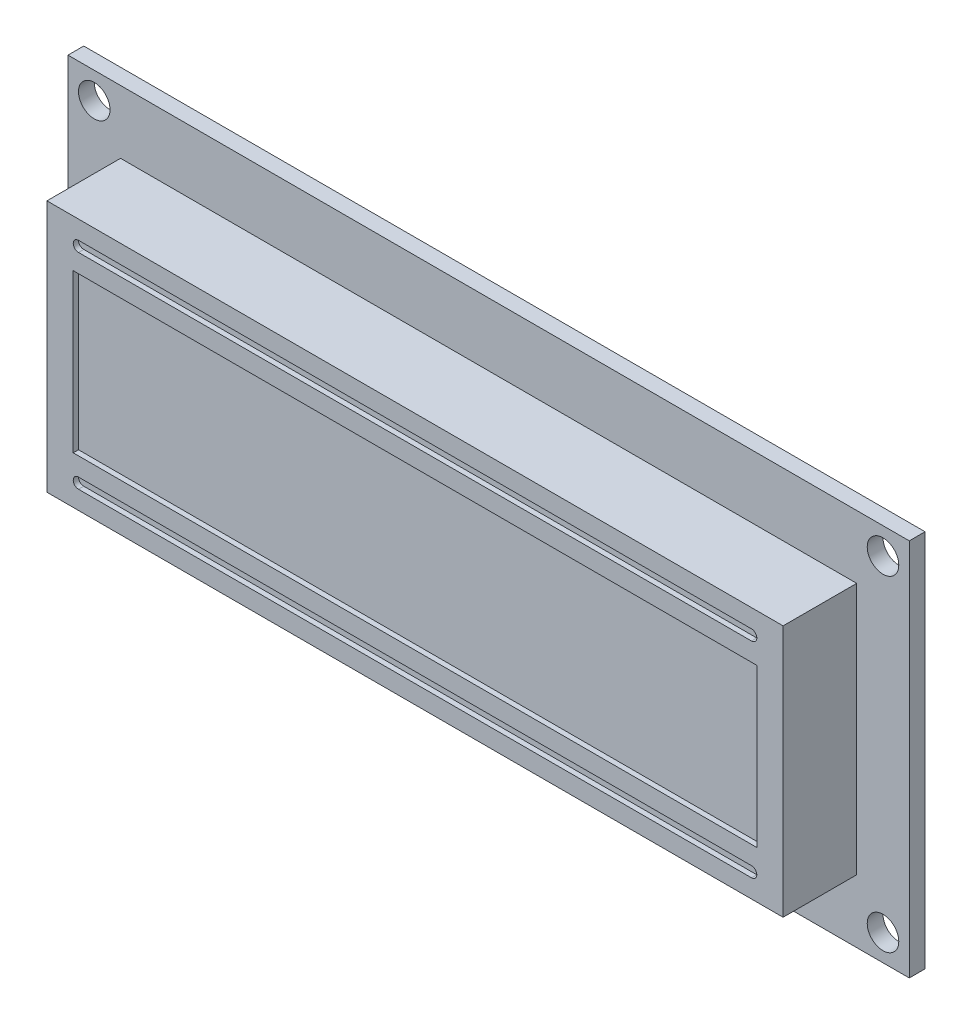
ISO-10303-21;
HEADER;
FILE_DESCRIPTION(('STEP AP214'),'2;1');
FILE_NAME('part.step','',(''),(''),'','','');
FILE_SCHEMA(('AUTOMOTIVE_DESIGN { 1 0 10303 214 1 1 1 1 }'));
ENDSEC;
DATA;
#1=APPLICATION_CONTEXT('core data for automotive mechanical design processes');
#2=APPLICATION_PROTOCOL_DEFINITION('international standard','automotive_design',2000,#1);
#3=PRODUCT_CONTEXT('',#1,'mechanical');
#4=PRODUCT('Part','Part','',(#3));
#5=PRODUCT_RELATED_PRODUCT_CATEGORY('part','',(#4));
#6=PRODUCT_DEFINITION_FORMATION('','',#4);
#7=PRODUCT_DEFINITION_CONTEXT('part definition',#1,'design');
#8=PRODUCT_DEFINITION('design','',#6,#7);
#9=PRODUCT_DEFINITION_SHAPE('','',#8);
#10=(LENGTH_UNIT() NAMED_UNIT(*) SI_UNIT(.MILLI.,.METRE.));
#11=(NAMED_UNIT(*) PLANE_ANGLE_UNIT() SI_UNIT($,.RADIAN.));
#12=(NAMED_UNIT(*) SI_UNIT($,.STERADIAN.) SOLID_ANGLE_UNIT());
#13=UNCERTAINTY_MEASURE_WITH_UNIT(LENGTH_MEASURE(1.E-05),#10,'distance_accuracy_value','');
#14=(GEOMETRIC_REPRESENTATION_CONTEXT(3) GLOBAL_UNCERTAINTY_ASSIGNED_CONTEXT((#13)) GLOBAL_UNIT_ASSIGNED_CONTEXT((#10,
#11,#12)) REPRESENTATION_CONTEXT('',''));
#15=CARTESIAN_POINT('',(0.,0.,0.));
#16=DIRECTION('',(0.,0.,1.));
#17=DIRECTION('',(1.,0.,0.));
#18=AXIS2_PLACEMENT_3D('',#15,#16,#17);
#19=CARTESIAN_POINT('',(0.,0.,0.));
#20=DIRECTION('',(0.,0.,1.));
#21=DIRECTION('',(1.,0.,0.));
#22=AXIS2_PLACEMENT_3D('',#19,#20,#21);
#23=PLANE('',#22);
#24=CARTESIAN_POINT('',(-37.5,-15.5,0.));
#25=DIRECTION('',(0.,0.,1.));
#26=DIRECTION('',(1.,0.,0.));
#27=AXIS2_PLACEMENT_3D('',#24,#25,#26);
#28=CIRCLE('',#27,1.5);
#29=CARTESIAN_POINT('',(-36.,-15.5,0.));
#30=VERTEX_POINT('',#29);
#31=EDGE_CURVE('E461',#30,#30,#28,.F.);
#32=ORIENTED_EDGE('',*,*,#31,.T.);
#33=EDGE_LOOP('',(#32));
#34=FACE_BOUND('',#33,.T.);
#35=CARTESIAN_POINT('',(-37.5,15.5,0.));
#36=DIRECTION('',(0.,0.,1.));
#37=DIRECTION('',(1.,0.,0.));
#38=AXIS2_PLACEMENT_3D('',#35,#36,#37);
#39=CIRCLE('',#38,1.5);
#40=CARTESIAN_POINT('',(-36.,15.5,0.));
#41=VERTEX_POINT('',#40);
#42=EDGE_CURVE('E465',#41,#41,#39,.F.);
#43=ORIENTED_EDGE('',*,*,#42,.T.);
#44=EDGE_LOOP('',(#43));
#45=FACE_BOUND('',#44,.T.);
#46=CARTESIAN_POINT('',(37.5,-15.5,0.));
#47=DIRECTION('',(0.,0.,1.));
#48=DIRECTION('',(1.,0.,0.));
#49=AXIS2_PLACEMENT_3D('',#46,#47,#48);
#50=CIRCLE('',#49,1.5);
#51=CARTESIAN_POINT('',(39.,-15.5,0.));
#52=VERTEX_POINT('',#51);
#53=EDGE_CURVE('E473',#52,#52,#50,.F.);
#54=ORIENTED_EDGE('',*,*,#53,.T.);
#55=EDGE_LOOP('',(#54));
#56=FACE_BOUND('',#55,.T.);
#57=CARTESIAN_POINT('',(37.5,15.5,0.));
#58=DIRECTION('',(0.,0.,1.));
#59=DIRECTION('',(1.,0.,0.));
#60=AXIS2_PLACEMENT_3D('',#57,#58,#59);
#61=CIRCLE('',#60,1.5);
#62=CARTESIAN_POINT('',(39.,15.5,0.));
#63=VERTEX_POINT('',#62);
#64=EDGE_CURVE('E199',#63,#63,#61,.F.);
#65=ORIENTED_EDGE('',*,*,#64,.T.);
#66=EDGE_LOOP('',(#65));
#67=FACE_BOUND('',#66,.T.);
#68=DIRECTION('',(0.,-1.,0.));
#69=VECTOR('',#68,1.);
#70=CARTESIAN_POINT('',(-40.,-18.,0.));
#71=LINE('',#70,#69);
#72=CARTESIAN_POINT('',(-40.,18.,0.));
#73=VERTEX_POINT('',#72);
#74=CARTESIAN_POINT('',(-40.,-18.,0.));
#75=VERTEX_POINT('',#74);
#76=EDGE_CURVE('E306',#73,#75,#71,.T.);
#77=ORIENTED_EDGE('',*,*,#76,.T.);
#78=DIRECTION('',(1.,0.,0.));
#79=VECTOR('',#78,1.);
#80=CARTESIAN_POINT('',(40.,-18.,0.));
#81=LINE('',#80,#79);
#82=CARTESIAN_POINT('',(40.,-18.,0.));
#83=VERTEX_POINT('',#82);
#84=EDGE_CURVE('E322',#75,#83,#81,.T.);
#85=ORIENTED_EDGE('',*,*,#84,.T.);
#86=DIRECTION('',(0.,1.,0.));
#87=VECTOR('',#86,1.);
#88=CARTESIAN_POINT('',(40.,-18.,0.));
#89=LINE('',#88,#87);
#90=CARTESIAN_POINT('',(40.,18.,0.));
#91=VERTEX_POINT('',#90);
#92=EDGE_CURVE('E325',#83,#91,#89,.T.);
#93=ORIENTED_EDGE('',*,*,#92,.T.);
#94=DIRECTION('',(-1.,0.,0.));
#95=VECTOR('',#94,1.);
#96=CARTESIAN_POINT('',(40.,18.,0.));
#97=LINE('',#96,#95);
#98=EDGE_CURVE('E311',#91,#73,#97,.T.);
#99=ORIENTED_EDGE('',*,*,#98,.T.);
#100=EDGE_LOOP('',(#77,#85,#93,#99));
#101=FACE_BOUND('',#100,.T.);
#102=DIRECTION('',(1.,0.,0.));
#103=VECTOR('',#102,1.);
#104=CARTESIAN_POINT('',(35.,-12.,0.));
#105=LINE('',#104,#103);
#106=CARTESIAN_POINT('',(-35.,-12.,0.));
#107=VERTEX_POINT('',#106);
#108=CARTESIAN_POINT('',(35.,-12.,0.));
#109=VERTEX_POINT('',#108);
#110=EDGE_CURVE('E291',#107,#109,#105,.T.);
#111=ORIENTED_EDGE('',*,*,#110,.F.);
#112=DIRECTION('',(0.,-1.,0.));
#113=VECTOR('',#112,1.);
#114=CARTESIAN_POINT('',(-35.,-12.,0.));
#115=LINE('',#114,#113);
#116=CARTESIAN_POINT('',(-35.,12.,0.));
#117=VERTEX_POINT('',#116);
#118=EDGE_CURVE('E271',#117,#107,#115,.T.);
#119=ORIENTED_EDGE('',*,*,#118,.F.);
#120=DIRECTION('',(-1.,0.,0.));
#121=VECTOR('',#120,1.);
#122=CARTESIAN_POINT('',(35.,12.,0.));
#123=LINE('',#122,#121);
#124=CARTESIAN_POINT('',(35.,12.,0.));
#125=VERTEX_POINT('',#124);
#126=EDGE_CURVE('E282',#125,#117,#123,.T.);
#127=ORIENTED_EDGE('',*,*,#126,.F.);
#128=DIRECTION('',(0.,1.,0.));
#129=VECTOR('',#128,1.);
#130=CARTESIAN_POINT('',(35.,-12.,0.));
#131=LINE('',#130,#129);
#132=EDGE_CURVE('E293',#109,#125,#131,.T.);
#133=ORIENTED_EDGE('',*,*,#132,.F.);
#134=EDGE_LOOP('',(#111,#119,#127,#133));
#135=FACE_BOUND('',#134,.T.);
#136=ADVANCED_FACE('F35',(#34,#45,#56,#67,#101,#135),#23,.T.);
#137=CARTESIAN_POINT('',(-40.,-18.,-1.5));
#138=DIRECTION('',(-1.,0.,0.));
#139=DIRECTION('',(0.,0.,1.));
#140=AXIS2_PLACEMENT_3D('',#137,#138,#139);
#141=PLANE('',#140);
#142=ORIENTED_EDGE('',*,*,#76,.F.);
#143=DIRECTION('',(0.,0.,1.));
#144=VECTOR('',#143,1.);
#145=CARTESIAN_POINT('',(-40.,18.,-1.5));
#146=LINE('',#145,#144);
#147=CARTESIAN_POINT('',(-40.,18.,-1.5));
#148=VERTEX_POINT('',#147);
#149=EDGE_CURVE('E11',#148,#73,#146,.T.);
#150=ORIENTED_EDGE('',*,*,#149,.F.);
#151=DIRECTION('',(0.,-1.,0.));
#152=VECTOR('',#151,1.);
#153=CARTESIAN_POINT('',(-40.,-18.,-1.5));
#154=LINE('',#153,#152);
#155=CARTESIAN_POINT('',(-40.,-18.,-1.5));
#156=VERTEX_POINT('',#155);
#157=EDGE_CURVE('E307',#148,#156,#154,.T.);
#158=ORIENTED_EDGE('',*,*,#157,.T.);
#159=DIRECTION('',(0.,0.,1.));
#160=VECTOR('',#159,1.);
#161=CARTESIAN_POINT('',(-40.,-18.,-1.5));
#162=LINE('',#161,#160);
#163=EDGE_CURVE('E39',#156,#75,#162,.T.);
#164=ORIENTED_EDGE('',*,*,#163,.T.);
#165=EDGE_LOOP('',(#142,#150,#158,#164));
#166=FACE_BOUND('',#165,.T.);
#167=ADVANCED_FACE('F37',(#166),#141,.T.);
#168=CARTESIAN_POINT('',(40.,18.,-1.5));
#169=DIRECTION('',(0.,1.,0.));
#170=DIRECTION('',(-1.,0.,0.));
#171=AXIS2_PLACEMENT_3D('',#168,#169,#170);
#172=PLANE('',#171);
#173=ORIENTED_EDGE('',*,*,#98,.F.);
#174=DIRECTION('',(0.,0.,1.));
#175=VECTOR('',#174,1.);
#176=CARTESIAN_POINT('',(40.,18.,-1.5));
#177=LINE('',#176,#175);
#178=CARTESIAN_POINT('',(40.,18.,-1.5));
#179=VERTEX_POINT('',#178);
#180=EDGE_CURVE('E44',#179,#91,#177,.T.);
#181=ORIENTED_EDGE('',*,*,#180,.F.);
#182=DIRECTION('',(-1.,0.,0.));
#183=VECTOR('',#182,1.);
#184=CARTESIAN_POINT('',(40.,18.,-1.5));
#185=LINE('',#184,#183);
#186=EDGE_CURVE('E317',#179,#148,#185,.T.);
#187=ORIENTED_EDGE('',*,*,#186,.T.);
#188=ORIENTED_EDGE('',*,*,#149,.T.);
#189=EDGE_LOOP('',(#173,#181,#187,#188));
#190=FACE_BOUND('',#189,.T.);
#191=ADVANCED_FACE('F343',(#190),#172,.T.);
#192=CARTESIAN_POINT('',(40.,-18.,-1.5));
#193=DIRECTION('',(1.,0.,0.));
#194=DIRECTION('',(0.,0.,-1.));
#195=AXIS2_PLACEMENT_3D('',#192,#193,#194);
#196=PLANE('',#195);
#197=ORIENTED_EDGE('',*,*,#92,.F.);
#198=DIRECTION('',(0.,0.,1.));
#199=VECTOR('',#198,1.);
#200=CARTESIAN_POINT('',(40.,-18.,-1.5));
#201=LINE('',#200,#199);
#202=CARTESIAN_POINT('',(40.,-18.,-1.5));
#203=VERTEX_POINT('',#202);
#204=EDGE_CURVE('E330',#203,#83,#201,.T.);
#205=ORIENTED_EDGE('',*,*,#204,.F.);
#206=DIRECTION('',(0.,1.,0.));
#207=VECTOR('',#206,1.);
#208=CARTESIAN_POINT('',(40.,-18.,-1.5));
#209=LINE('',#208,#207);
#210=EDGE_CURVE('E314',#203,#179,#209,.T.);
#211=ORIENTED_EDGE('',*,*,#210,.T.);
#212=ORIENTED_EDGE('',*,*,#180,.T.);
#213=EDGE_LOOP('',(#197,#205,#211,#212));
#214=FACE_BOUND('',#213,.T.);
#215=ADVANCED_FACE('F349',(#214),#196,.T.);
#216=CARTESIAN_POINT('',(40.,-18.,-1.5));
#217=DIRECTION('',(0.,-1.,0.));
#218=DIRECTION('',(1.,0.,0.));
#219=AXIS2_PLACEMENT_3D('',#216,#217,#218);
#220=PLANE('',#219);
#221=ORIENTED_EDGE('',*,*,#84,.F.);
#222=ORIENTED_EDGE('',*,*,#163,.F.);
#223=DIRECTION('',(1.,0.,0.));
#224=VECTOR('',#223,1.);
#225=CARTESIAN_POINT('',(40.,-18.,-1.5));
#226=LINE('',#225,#224);
#227=EDGE_CURVE('E310',#156,#203,#226,.T.);
#228=ORIENTED_EDGE('',*,*,#227,.T.);
#229=ORIENTED_EDGE('',*,*,#204,.T.);
#230=EDGE_LOOP('',(#221,#222,#228,#229));
#231=FACE_BOUND('',#230,.T.);
#232=ADVANCED_FACE('F338',(#231),#220,.T.);
#233=CARTESIAN_POINT('',(0.,0.,-1.5));
#234=DIRECTION('',(0.,0.,1.));
#235=DIRECTION('',(1.,0.,0.));
#236=AXIS2_PLACEMENT_3D('',#233,#234,#235);
#237=PLANE('',#236);
#238=CARTESIAN_POINT('',(-37.5,-15.5,-1.5));
#239=DIRECTION('',(0.,0.,-1.));
#240=DIRECTION('',(-1.,0.,0.));
#241=AXIS2_PLACEMENT_3D('',#238,#239,#240);
#242=CIRCLE('',#241,1.5);
#243=CARTESIAN_POINT('',(-39.,-15.5,-1.5));
#244=VERTEX_POINT('',#243);
#245=EDGE_CURVE('E464',#244,#244,#242,.T.);
#246=ORIENTED_EDGE('',*,*,#245,.F.);
#247=EDGE_LOOP('',(#246));
#248=FACE_BOUND('',#247,.T.);
#249=CARTESIAN_POINT('',(-37.5,15.5,-1.5));
#250=DIRECTION('',(0.,0.,-1.));
#251=DIRECTION('',(-1.,0.,0.));
#252=AXIS2_PLACEMENT_3D('',#249,#250,#251);
#253=CIRCLE('',#252,1.5);
#254=CARTESIAN_POINT('',(-39.,15.5,-1.5));
#255=VERTEX_POINT('',#254);
#256=EDGE_CURVE('E468',#255,#255,#253,.T.);
#257=ORIENTED_EDGE('',*,*,#256,.F.);
#258=EDGE_LOOP('',(#257));
#259=FACE_BOUND('',#258,.T.);
#260=CARTESIAN_POINT('',(37.5,-15.5,-1.5));
#261=DIRECTION('',(0.,0.,-1.));
#262=DIRECTION('',(-1.,0.,0.));
#263=AXIS2_PLACEMENT_3D('',#260,#261,#262);
#264=CIRCLE('',#263,1.5);
#265=CARTESIAN_POINT('',(36.,-15.5,-1.5));
#266=VERTEX_POINT('',#265);
#267=EDGE_CURVE('E475',#266,#266,#264,.T.);
#268=ORIENTED_EDGE('',*,*,#267,.F.);
#269=EDGE_LOOP('',(#268));
#270=FACE_BOUND('',#269,.T.);
#271=CARTESIAN_POINT('',(37.5,15.5,-1.5));
#272=DIRECTION('',(0.,0.,-1.));
#273=DIRECTION('',(-1.,0.,0.));
#274=AXIS2_PLACEMENT_3D('',#271,#272,#273);
#275=CIRCLE('',#274,1.5);
#276=CARTESIAN_POINT('',(36.,15.5,-1.5));
#277=VERTEX_POINT('',#276);
#278=EDGE_CURVE('E206',#277,#277,#275,.T.);
#279=ORIENTED_EDGE('',*,*,#278,.F.);
#280=EDGE_LOOP('',(#279));
#281=FACE_BOUND('',#280,.T.);
#282=ORIENTED_EDGE('',*,*,#157,.F.);
#283=ORIENTED_EDGE('',*,*,#186,.F.);
#284=ORIENTED_EDGE('',*,*,#210,.F.);
#285=ORIENTED_EDGE('',*,*,#227,.F.);
#286=EDGE_LOOP('',(#282,#283,#284,#285));
#287=FACE_BOUND('',#286,.T.);
#288=ADVANCED_FACE('F346',(#248,#259,#270,#281,#287),#237,.F.);
#289=CARTESIAN_POINT('',(-35.,-12.,7.));
#290=DIRECTION('',(1.,0.,0.));
#291=DIRECTION('',(0.,0.,-1.));
#292=AXIS2_PLACEMENT_3D('',#289,#290,#291);
#293=PLANE('',#292);
#294=ORIENTED_EDGE('',*,*,#118,.T.);
#295=DIRECTION('',(0.,0.,-1.));
#296=VECTOR('',#295,1.);
#297=CARTESIAN_POINT('',(-35.,-12.,7.));
#298=LINE('',#297,#296);
#299=CARTESIAN_POINT('',(-35.,-12.,7.));
#300=VERTEX_POINT('',#299);
#301=EDGE_CURVE('E304',#300,#107,#298,.T.);
#302=ORIENTED_EDGE('',*,*,#301,.F.);
#303=DIRECTION('',(0.,-1.,0.));
#304=VECTOR('',#303,1.);
#305=CARTESIAN_POINT('',(-35.,-12.,7.));
#306=LINE('',#305,#304);
#307=CARTESIAN_POINT('',(-35.,12.,7.));
#308=VERTEX_POINT('',#307);
#309=EDGE_CURVE('E278',#308,#300,#306,.T.);
#310=ORIENTED_EDGE('',*,*,#309,.F.);
#311=DIRECTION('',(0.,0.,-1.));
#312=VECTOR('',#311,1.);
#313=CARTESIAN_POINT('',(-35.,12.,7.));
#314=LINE('',#313,#312);
#315=EDGE_CURVE('E288',#308,#117,#314,.T.);
#316=ORIENTED_EDGE('',*,*,#315,.T.);
#317=EDGE_LOOP('',(#294,#302,#310,#316));
#318=FACE_BOUND('',#317,.T.);
#319=ADVANCED_FACE('F368',(#318),#293,.F.);
#320=CARTESIAN_POINT('',(35.,-12.,7.));
#321=DIRECTION('',(0.,1.,0.));
#322=DIRECTION('',(-1.,0.,0.));
#323=AXIS2_PLACEMENT_3D('',#320,#321,#322);
#324=PLANE('',#323);
#325=ORIENTED_EDGE('',*,*,#110,.T.);
#326=DIRECTION('',(0.,0.,-1.));
#327=VECTOR('',#326,1.);
#328=CARTESIAN_POINT('',(35.,-12.,7.));
#329=LINE('',#328,#327);
#330=CARTESIAN_POINT('',(35.,-12.,7.));
#331=VERTEX_POINT('',#330);
#332=EDGE_CURVE('E301',#331,#109,#329,.T.);
#333=ORIENTED_EDGE('',*,*,#332,.F.);
#334=DIRECTION('',(1.,0.,0.));
#335=VECTOR('',#334,1.);
#336=CARTESIAN_POINT('',(35.,-12.,7.));
#337=LINE('',#336,#335);
#338=EDGE_CURVE('E281',#300,#331,#337,.T.);
#339=ORIENTED_EDGE('',*,*,#338,.F.);
#340=ORIENTED_EDGE('',*,*,#301,.T.);
#341=EDGE_LOOP('',(#325,#333,#339,#340));
#342=FACE_BOUND('',#341,.T.);
#343=ADVANCED_FACE('F372',(#342),#324,.F.);
#344=CARTESIAN_POINT('',(35.,-12.,7.));
#345=DIRECTION('',(-1.,0.,0.));
#346=DIRECTION('',(0.,0.,1.));
#347=AXIS2_PLACEMENT_3D('',#344,#345,#346);
#348=PLANE('',#347);
#349=ORIENTED_EDGE('',*,*,#132,.T.);
#350=DIRECTION('',(0.,0.,-1.));
#351=VECTOR('',#350,1.);
#352=CARTESIAN_POINT('',(35.,12.,7.));
#353=LINE('',#352,#351);
#354=CARTESIAN_POINT('',(35.,12.,7.));
#355=VERTEX_POINT('',#354);
#356=EDGE_CURVE('E299',#355,#125,#353,.T.);
#357=ORIENTED_EDGE('',*,*,#356,.F.);
#358=DIRECTION('',(0.,1.,0.));
#359=VECTOR('',#358,1.);
#360=CARTESIAN_POINT('',(35.,-12.,7.));
#361=LINE('',#360,#359);
#362=EDGE_CURVE('E284',#331,#355,#361,.T.);
#363=ORIENTED_EDGE('',*,*,#362,.F.);
#364=ORIENTED_EDGE('',*,*,#332,.T.);
#365=EDGE_LOOP('',(#349,#357,#363,#364));
#366=FACE_BOUND('',#365,.T.);
#367=ADVANCED_FACE('F376',(#366),#348,.F.);
#368=CARTESIAN_POINT('',(35.,12.,7.));
#369=DIRECTION('',(0.,-1.,0.));
#370=DIRECTION('',(1.,0.,0.));
#371=AXIS2_PLACEMENT_3D('',#368,#369,#370);
#372=PLANE('',#371);
#373=ORIENTED_EDGE('',*,*,#126,.T.);
#374=ORIENTED_EDGE('',*,*,#315,.F.);
#375=DIRECTION('',(-1.,0.,0.));
#376=VECTOR('',#375,1.);
#377=CARTESIAN_POINT('',(35.,12.,7.));
#378=LINE('',#377,#376);
#379=EDGE_CURVE('E286',#355,#308,#378,.T.);
#380=ORIENTED_EDGE('',*,*,#379,.F.);
#381=ORIENTED_EDGE('',*,*,#356,.T.);
#382=EDGE_LOOP('',(#373,#374,#380,#381));
#383=FACE_BOUND('',#382,.T.);
#384=ADVANCED_FACE('F380',(#383),#372,.F.);
#385=CARTESIAN_POINT('',(0.,0.,7.));
#386=DIRECTION('',(0.,0.,1.));
#387=DIRECTION('',(1.,0.,0.));
#388=AXIS2_PLACEMENT_3D('',#385,#386,#387);
#389=PLANE('',#388);
#390=CARTESIAN_POINT('',(32.,-9.74999999999999,7.));
#391=DIRECTION('',(0.,0.,1.));
#392=DIRECTION('',(-1.,0.,0.));
#393=AXIS2_PLACEMENT_3D('',#390,#391,#392);
#394=CIRCLE('',#393,0.500000000000001);
#395=CARTESIAN_POINT('',(32.,-10.25,7.));
#396=VERTEX_POINT('',#395);
#397=CARTESIAN_POINT('',(32.,-9.24999999999999,7.));
#398=VERTEX_POINT('',#397);
#399=EDGE_CURVE('E52',#396,#398,#394,.T.);
#400=ORIENTED_EDGE('',*,*,#399,.F.);
#401=DIRECTION('',(1.,0.,0.));
#402=VECTOR('',#401,1.);
#403=CARTESIAN_POINT('',(32.,-10.25,7.));
#404=LINE('',#403,#402);
#405=CARTESIAN_POINT('',(-32.,-10.25,7.));
#406=VERTEX_POINT('',#405);
#407=EDGE_CURVE('E193',#406,#396,#404,.T.);
#408=ORIENTED_EDGE('',*,*,#407,.F.);
#409=CARTESIAN_POINT('',(-32.,-9.75,7.));
#410=DIRECTION('',(0.,0.,1.));
#411=DIRECTION('',(-1.,0.,0.));
#412=AXIS2_PLACEMENT_3D('',#409,#410,#411);
#413=CIRCLE('',#412,0.500000000000001);
#414=CARTESIAN_POINT('',(-32.,-9.25,7.));
#415=VERTEX_POINT('',#414);
#416=EDGE_CURVE('E196',#415,#406,#413,.T.);
#417=ORIENTED_EDGE('',*,*,#416,.F.);
#418=DIRECTION('',(-1.,0.,0.));
#419=VECTOR('',#418,1.);
#420=CARTESIAN_POINT('',(32.,-9.24999999999999,7.));
#421=LINE('',#420,#419);
#422=EDGE_CURVE('E205',#398,#415,#421,.T.);
#423=ORIENTED_EDGE('',*,*,#422,.F.);
#424=EDGE_LOOP('',(#400,#408,#417,#423));
#425=FACE_BOUND('',#424,.T.);
#426=CARTESIAN_POINT('',(32.,9.75,7.));
#427=DIRECTION('',(0.,0.,1.));
#428=DIRECTION('',(1.,0.,0.));
#429=AXIS2_PLACEMENT_3D('',#426,#427,#428);
#430=CIRCLE('',#429,0.500000000000001);
#431=CARTESIAN_POINT('',(32.,9.25,7.));
#432=VERTEX_POINT('',#431);
#433=CARTESIAN_POINT('',(32.,10.25,7.));
#434=VERTEX_POINT('',#433);
#435=EDGE_CURVE('E60',#432,#434,#430,.T.);
#436=ORIENTED_EDGE('',*,*,#435,.F.);
#437=DIRECTION('',(1.,0.,0.));
#438=VECTOR('',#437,1.);
#439=CARTESIAN_POINT('',(32.,9.25,7.));
#440=LINE('',#439,#438);
#441=CARTESIAN_POINT('',(-32.,9.25,7.));
#442=VERTEX_POINT('',#441);
#443=EDGE_CURVE('E219',#442,#432,#440,.T.);
#444=ORIENTED_EDGE('',*,*,#443,.F.);
#445=CARTESIAN_POINT('',(-32.,9.75,7.));
#446=DIRECTION('',(0.,0.,1.));
#447=DIRECTION('',(1.,0.,0.));
#448=AXIS2_PLACEMENT_3D('',#445,#446,#447);
#449=CIRCLE('',#448,0.500000000000001);
#450=CARTESIAN_POINT('',(-32.,10.25,7.));
#451=VERTEX_POINT('',#450);
#452=EDGE_CURVE('E233',#451,#442,#449,.T.);
#453=ORIENTED_EDGE('',*,*,#452,.F.);
#454=DIRECTION('',(-1.,0.,0.));
#455=VECTOR('',#454,1.);
#456=CARTESIAN_POINT('',(32.,10.25,7.));
#457=LINE('',#456,#455);
#458=EDGE_CURVE('E230',#434,#451,#457,.T.);
#459=ORIENTED_EDGE('',*,*,#458,.F.);
#460=EDGE_LOOP('',(#436,#444,#453,#459));
#461=FACE_BOUND('',#460,.T.);
#462=DIRECTION('',(0.,-1.,0.));
#463=VECTOR('',#462,1.);
#464=CARTESIAN_POINT('',(-32.5,-7.50000000000001,7.));
#465=LINE('',#464,#463);
#466=CARTESIAN_POINT('',(-32.5,7.5,7.));
#467=VERTEX_POINT('',#466);
#468=CARTESIAN_POINT('',(-32.5,-7.50000000000001,7.));
#469=VERTEX_POINT('',#468);
#470=EDGE_CURVE('E240',#467,#469,#465,.T.);
#471=ORIENTED_EDGE('',*,*,#470,.F.);
#472=DIRECTION('',(-1.,0.,0.));
#473=VECTOR('',#472,1.);
#474=CARTESIAN_POINT('',(32.5,7.5,7.));
#475=LINE('',#474,#473);
#476=CARTESIAN_POINT('',(32.5,7.5,7.));
#477=VERTEX_POINT('',#476);
#478=EDGE_CURVE('E250',#477,#467,#475,.T.);
#479=ORIENTED_EDGE('',*,*,#478,.F.);
#480=DIRECTION('',(0.,1.,0.));
#481=VECTOR('',#480,1.);
#482=CARTESIAN_POINT('',(32.5,-7.5,7.));
#483=LINE('',#482,#481);
#484=CARTESIAN_POINT('',(32.5,-7.5,7.));
#485=VERTEX_POINT('',#484);
#486=EDGE_CURVE('E264',#485,#477,#483,.T.);
#487=ORIENTED_EDGE('',*,*,#486,.F.);
#488=DIRECTION('',(1.,0.,0.));
#489=VECTOR('',#488,1.);
#490=CARTESIAN_POINT('',(32.5,-7.5,7.));
#491=LINE('',#490,#489);
#492=EDGE_CURVE('E261',#469,#485,#491,.T.);
#493=ORIENTED_EDGE('',*,*,#492,.F.);
#494=EDGE_LOOP('',(#471,#479,#487,#493));
#495=FACE_BOUND('',#494,.T.);
#496=ORIENTED_EDGE('',*,*,#309,.T.);
#497=ORIENTED_EDGE('',*,*,#338,.T.);
#498=ORIENTED_EDGE('',*,*,#362,.T.);
#499=ORIENTED_EDGE('',*,*,#379,.T.);
#500=EDGE_LOOP('',(#496,#497,#498,#499));
#501=FACE_BOUND('',#500,.T.);
#502=ADVANCED_FACE('F384',(#425,#461,#495,#501),#389,.T.);
#503=CARTESIAN_POINT('',(-32.5,-7.50000000000001,6.5));
#504=DIRECTION('',(-1.,0.,0.));
#505=DIRECTION('',(0.,0.,1.));
#506=AXIS2_PLACEMENT_3D('',#503,#504,#505);
#507=PLANE('',#506);
#508=ORIENTED_EDGE('',*,*,#470,.T.);
#509=DIRECTION('',(0.,0.,1.));
#510=VECTOR('',#509,1.);
#511=CARTESIAN_POINT('',(-32.5,-7.50000000000001,6.5));
#512=LINE('',#511,#510);
#513=CARTESIAN_POINT('',(-32.5,-7.50000000000001,6.5));
#514=VERTEX_POINT('',#513);
#515=EDGE_CURVE('E259',#514,#469,#512,.T.);
#516=ORIENTED_EDGE('',*,*,#515,.F.);
#517=DIRECTION('',(0.,-1.,0.));
#518=VECTOR('',#517,1.);
#519=CARTESIAN_POINT('',(-32.5,-7.50000000000001,6.5));
#520=LINE('',#519,#518);
#521=CARTESIAN_POINT('',(-32.5,7.5,6.5));
#522=VERTEX_POINT('',#521);
#523=EDGE_CURVE('E246',#522,#514,#520,.T.);
#524=ORIENTED_EDGE('',*,*,#523,.F.);
#525=DIRECTION('',(0.,0.,1.));
#526=VECTOR('',#525,1.);
#527=CARTESIAN_POINT('',(-32.5,7.5,6.5));
#528=LINE('',#527,#526);
#529=EDGE_CURVE('E269',#522,#467,#528,.T.);
#530=ORIENTED_EDGE('',*,*,#529,.T.);
#531=EDGE_LOOP('',(#508,#516,#524,#530));
#532=FACE_BOUND('',#531,.T.);
#533=ADVANCED_FACE('F388',(#532),#507,.F.);
#534=CARTESIAN_POINT('',(32.5,7.5,6.5));
#535=DIRECTION('',(0.,1.,0.));
#536=DIRECTION('',(-1.,0.,0.));
#537=AXIS2_PLACEMENT_3D('',#534,#535,#536);
#538=PLANE('',#537);
#539=ORIENTED_EDGE('',*,*,#478,.T.);
#540=ORIENTED_EDGE('',*,*,#529,.F.);
#541=DIRECTION('',(-1.,0.,0.));
#542=VECTOR('',#541,1.);
#543=CARTESIAN_POINT('',(32.5,7.5,6.5));
#544=LINE('',#543,#542);
#545=CARTESIAN_POINT('',(32.5,7.5,6.5));
#546=VERTEX_POINT('',#545);
#547=EDGE_CURVE('E256',#546,#522,#544,.T.);
#548=ORIENTED_EDGE('',*,*,#547,.F.);
#549=DIRECTION('',(0.,0.,1.));
#550=VECTOR('',#549,1.);
#551=CARTESIAN_POINT('',(32.5,7.5,6.5));
#552=LINE('',#551,#550);
#553=EDGE_CURVE('E272',#546,#477,#552,.T.);
#554=ORIENTED_EDGE('',*,*,#553,.T.);
#555=EDGE_LOOP('',(#539,#540,#548,#554));
#556=FACE_BOUND('',#555,.T.);
#557=ADVANCED_FACE('F392',(#556),#538,.F.);
#558=CARTESIAN_POINT('',(32.5,-7.5,6.5));
#559=DIRECTION('',(1.,0.,0.));
#560=DIRECTION('',(0.,0.,-1.));
#561=AXIS2_PLACEMENT_3D('',#558,#559,#560);
#562=PLANE('',#561);
#563=ORIENTED_EDGE('',*,*,#486,.T.);
#564=ORIENTED_EDGE('',*,*,#553,.F.);
#565=DIRECTION('',(0.,1.,0.));
#566=VECTOR('',#565,1.);
#567=CARTESIAN_POINT('',(32.5,-7.5,6.5));
#568=LINE('',#567,#566);
#569=CARTESIAN_POINT('',(32.5,-7.5,6.5));
#570=VERTEX_POINT('',#569);
#571=EDGE_CURVE('E253',#570,#546,#568,.T.);
#572=ORIENTED_EDGE('',*,*,#571,.F.);
#573=DIRECTION('',(0.,0.,1.));
#574=VECTOR('',#573,1.);
#575=CARTESIAN_POINT('',(32.5,-7.5,6.5));
#576=LINE('',#575,#574);
#577=EDGE_CURVE('E274',#570,#485,#576,.T.);
#578=ORIENTED_EDGE('',*,*,#577,.T.);
#579=EDGE_LOOP('',(#563,#564,#572,#578));
#580=FACE_BOUND('',#579,.T.);
#581=ADVANCED_FACE('F398',(#580),#562,.F.);
#582=CARTESIAN_POINT('',(32.5,-7.5,6.5));
#583=DIRECTION('',(0.,-1.,0.));
#584=DIRECTION('',(1.,0.,0.));
#585=AXIS2_PLACEMENT_3D('',#582,#583,#584);
#586=PLANE('',#585);
#587=ORIENTED_EDGE('',*,*,#492,.T.);
#588=ORIENTED_EDGE('',*,*,#577,.F.);
#589=DIRECTION('',(1.,0.,0.));
#590=VECTOR('',#589,1.);
#591=CARTESIAN_POINT('',(32.5,-7.5,6.5));
#592=LINE('',#591,#590);
#593=EDGE_CURVE('E249',#514,#570,#592,.T.);
#594=ORIENTED_EDGE('',*,*,#593,.F.);
#595=ORIENTED_EDGE('',*,*,#515,.T.);
#596=EDGE_LOOP('',(#587,#588,#594,#595));
#597=FACE_BOUND('',#596,.T.);
#598=ADVANCED_FACE('F394',(#597),#586,.F.);
#599=CARTESIAN_POINT('',(0.,0.,6.5));
#600=DIRECTION('',(0.,0.,1.));
#601=DIRECTION('',(1.,0.,0.));
#602=AXIS2_PLACEMENT_3D('',#599,#600,#601);
#603=PLANE('',#602);
#604=ORIENTED_EDGE('',*,*,#523,.T.);
#605=ORIENTED_EDGE('',*,*,#593,.T.);
#606=ORIENTED_EDGE('',*,*,#571,.T.);
#607=ORIENTED_EDGE('',*,*,#547,.T.);
#608=EDGE_LOOP('',(#604,#605,#606,#607));
#609=FACE_BOUND('',#608,.T.);
#610=ADVANCED_FACE('F397',(#609),#603,.T.);
#611=CARTESIAN_POINT('',(32.,9.75,6.5));
#612=DIRECTION('',(0.,0.,1.));
#613=DIRECTION('',(1.,0.,0.));
#614=AXIS2_PLACEMENT_3D('',#611,#612,#613);
#615=CYLINDRICAL_SURFACE('',#614,0.500000000000001);
#616=ORIENTED_EDGE('',*,*,#435,.T.);
#617=DIRECTION('',(0.,0.,1.));
#618=VECTOR('',#617,1.);
#619=CARTESIAN_POINT('',(32.,10.25,6.5));
#620=LINE('',#619,#618);
#621=CARTESIAN_POINT('',(32.,10.25,6.5));
#622=VERTEX_POINT('',#621);
#623=EDGE_CURVE('E228',#622,#434,#620,.T.);
#624=ORIENTED_EDGE('',*,*,#623,.F.);
#625=CARTESIAN_POINT('',(32.,9.75,6.5));
#626=DIRECTION('',(0.,0.,1.));
#627=DIRECTION('',(1.,0.,0.));
#628=AXIS2_PLACEMENT_3D('',#625,#626,#627);
#629=CIRCLE('',#628,0.500000000000001);
#630=CARTESIAN_POINT('',(32.,9.25,6.5));
#631=VERTEX_POINT('',#630);
#632=EDGE_CURVE('E215',#631,#622,#629,.T.);
#633=ORIENTED_EDGE('',*,*,#632,.F.);
#634=DIRECTION('',(0.,0.,1.));
#635=VECTOR('',#634,1.);
#636=CARTESIAN_POINT('',(32.,9.25,6.5));
#637=LINE('',#636,#635);
#638=EDGE_CURVE('E238',#631,#432,#637,.T.);
#639=ORIENTED_EDGE('',*,*,#638,.T.);
#640=EDGE_LOOP('',(#616,#624,#633,#639));
#641=FACE_BOUND('',#640,.T.);
#642=ADVANCED_FACE('F408',(#641),#615,.F.);
#643=CARTESIAN_POINT('',(32.,9.25,6.5));
#644=DIRECTION('',(0.,-1.,0.));
#645=DIRECTION('',(0.,0.,-1.));
#646=AXIS2_PLACEMENT_3D('',#643,#644,#645);
#647=PLANE('',#646);
#648=ORIENTED_EDGE('',*,*,#443,.T.);
#649=ORIENTED_EDGE('',*,*,#638,.F.);
#650=DIRECTION('',(1.,0.,0.));
#651=VECTOR('',#650,1.);
#652=CARTESIAN_POINT('',(32.,9.25,6.5));
#653=LINE('',#652,#651);
#654=CARTESIAN_POINT('',(-32.,9.25,6.5));
#655=VERTEX_POINT('',#654);
#656=EDGE_CURVE('E225',#655,#631,#653,.T.);
#657=ORIENTED_EDGE('',*,*,#656,.F.);
#658=DIRECTION('',(0.,0.,1.));
#659=VECTOR('',#658,1.);
#660=CARTESIAN_POINT('',(-32.,9.25,6.5));
#661=LINE('',#660,#659);
#662=EDGE_CURVE('E241',#655,#442,#661,.T.);
#663=ORIENTED_EDGE('',*,*,#662,.T.);
#664=EDGE_LOOP('',(#648,#649,#657,#663));
#665=FACE_BOUND('',#664,.T.);
#666=ADVANCED_FACE('F412',(#665),#647,.F.);
#667=CARTESIAN_POINT('',(-32.,9.75,6.5));
#668=DIRECTION('',(0.,0.,1.));
#669=DIRECTION('',(1.,0.,0.));
#670=AXIS2_PLACEMENT_3D('',#667,#668,#669);
#671=CYLINDRICAL_SURFACE('',#670,0.500000000000001);
#672=ORIENTED_EDGE('',*,*,#452,.T.);
#673=ORIENTED_EDGE('',*,*,#662,.F.);
#674=CARTESIAN_POINT('',(-32.,9.75,6.5));
#675=DIRECTION('',(0.,0.,1.));
#676=DIRECTION('',(1.,0.,0.));
#677=AXIS2_PLACEMENT_3D('',#674,#675,#676);
#678=CIRCLE('',#677,0.500000000000001);
#679=CARTESIAN_POINT('',(-32.,10.25,6.5));
#680=VERTEX_POINT('',#679);
#681=EDGE_CURVE('E222',#680,#655,#678,.T.);
#682=ORIENTED_EDGE('',*,*,#681,.F.);
#683=DIRECTION('',(0.,0.,1.));
#684=VECTOR('',#683,1.);
#685=CARTESIAN_POINT('',(-32.,10.25,6.5));
#686=LINE('',#685,#684);
#687=EDGE_CURVE('E243',#680,#451,#686,.T.);
#688=ORIENTED_EDGE('',*,*,#687,.T.);
#689=EDGE_LOOP('',(#672,#673,#682,#688));
#690=FACE_BOUND('',#689,.T.);
#691=ADVANCED_FACE('F417',(#690),#671,.F.);
#692=CARTESIAN_POINT('',(32.,10.25,6.5));
#693=DIRECTION('',(0.,1.,0.));
#694=DIRECTION('',(0.,0.,1.));
#695=AXIS2_PLACEMENT_3D('',#692,#693,#694);
#696=PLANE('',#695);
#697=ORIENTED_EDGE('',*,*,#458,.T.);
#698=ORIENTED_EDGE('',*,*,#687,.F.);
#699=DIRECTION('',(-1.,0.,0.));
#700=VECTOR('',#699,1.);
#701=CARTESIAN_POINT('',(32.,10.25,6.5));
#702=LINE('',#701,#700);
#703=EDGE_CURVE('E218',#622,#680,#702,.T.);
#704=ORIENTED_EDGE('',*,*,#703,.F.);
#705=ORIENTED_EDGE('',*,*,#623,.T.);
#706=EDGE_LOOP('',(#697,#698,#704,#705));
#707=FACE_BOUND('',#706,.T.);
#708=ADVANCED_FACE('F413',(#707),#696,.F.);
#709=CARTESIAN_POINT('',(32.,9.75,6.5));
#710=DIRECTION('',(0.,0.,1.));
#711=DIRECTION('',(1.,0.,0.));
#712=AXIS2_PLACEMENT_3D('',#709,#710,#711);
#713=PLANE('',#712);
#714=ORIENTED_EDGE('',*,*,#632,.T.);
#715=ORIENTED_EDGE('',*,*,#703,.T.);
#716=ORIENTED_EDGE('',*,*,#681,.T.);
#717=ORIENTED_EDGE('',*,*,#656,.T.);
#718=EDGE_LOOP('',(#714,#715,#716,#717));
#719=FACE_BOUND('',#718,.T.);
#720=ADVANCED_FACE('F416',(#719),#713,.T.);
#721=CARTESIAN_POINT('',(32.,-9.74999999999999,6.5));
#722=DIRECTION('',(0.,0.,1.));
#723=DIRECTION('',(1.,0.,0.));
#724=AXIS2_PLACEMENT_3D('',#721,#722,#723);
#725=CYLINDRICAL_SURFACE('',#724,0.500000000000001);
#726=ORIENTED_EDGE('',*,*,#399,.T.);
#727=DIRECTION('',(0.,0.,1.));
#728=VECTOR('',#727,1.);
#729=CARTESIAN_POINT('',(32.,-9.24999999999999,6.5));
#730=LINE('',#729,#728);
#731=CARTESIAN_POINT('',(32.,-9.24999999999999,6.5));
#732=VERTEX_POINT('',#731);
#733=EDGE_CURVE('E171',#732,#398,#730,.T.);
#734=ORIENTED_EDGE('',*,*,#733,.F.);
#735=CARTESIAN_POINT('',(32.,-9.74999999999999,6.5));
#736=DIRECTION('',(0.,0.,1.));
#737=DIRECTION('',(-1.,0.,0.));
#738=AXIS2_PLACEMENT_3D('',#735,#736,#737);
#739=CIRCLE('',#738,0.500000000000001);
#740=CARTESIAN_POINT('',(32.,-10.25,6.5));
#741=VERTEX_POINT('',#740);
#742=EDGE_CURVE('E175',#741,#732,#739,.T.);
#743=ORIENTED_EDGE('',*,*,#742,.F.);
#744=DIRECTION('',(0.,0.,1.));
#745=VECTOR('',#744,1.);
#746=CARTESIAN_POINT('',(32.,-10.25,6.5));
#747=LINE('',#746,#745);
#748=EDGE_CURVE('E210',#741,#396,#747,.T.);
#749=ORIENTED_EDGE('',*,*,#748,.T.);
#750=EDGE_LOOP('',(#726,#734,#743,#749));
#751=FACE_BOUND('',#750,.T.);
#752=ADVANCED_FACE('F173',(#751),#725,.F.);
#753=CARTESIAN_POINT('',(32.,-10.25,6.5));
#754=DIRECTION('',(0.,-1.,0.));
#755=DIRECTION('',(1.,0.,0.));
#756=AXIS2_PLACEMENT_3D('',#753,#754,#755);
#757=PLANE('',#756);
#758=ORIENTED_EDGE('',*,*,#407,.T.);
#759=ORIENTED_EDGE('',*,*,#748,.F.);
#760=DIRECTION('',(1.,0.,0.));
#761=VECTOR('',#760,1.);
#762=CARTESIAN_POINT('',(32.,-10.25,6.5));
#763=LINE('',#762,#761);
#764=CARTESIAN_POINT('',(-32.,-10.25,6.5));
#765=VERTEX_POINT('',#764);
#766=EDGE_CURVE('E181',#765,#741,#763,.T.);
#767=ORIENTED_EDGE('',*,*,#766,.F.);
#768=DIRECTION('',(0.,0.,1.));
#769=VECTOR('',#768,1.);
#770=CARTESIAN_POINT('',(-32.,-10.25,6.5));
#771=LINE('',#770,#769);
#772=EDGE_CURVE('E212',#765,#406,#771,.T.);
#773=ORIENTED_EDGE('',*,*,#772,.T.);
#774=EDGE_LOOP('',(#758,#759,#767,#773));
#775=FACE_BOUND('',#774,.T.);
#776=ADVANCED_FACE('F430',(#775),#757,.F.);
#777=CARTESIAN_POINT('',(-32.,-9.75,6.5));
#778=DIRECTION('',(0.,0.,1.));
#779=DIRECTION('',(1.,0.,0.));
#780=AXIS2_PLACEMENT_3D('',#777,#778,#779);
#781=CYLINDRICAL_SURFACE('',#780,0.500000000000001);
#782=ORIENTED_EDGE('',*,*,#416,.T.);
#783=ORIENTED_EDGE('',*,*,#772,.F.);
#784=CARTESIAN_POINT('',(-32.,-9.75,6.5));
#785=DIRECTION('',(0.,0.,1.));
#786=DIRECTION('',(-1.,0.,0.));
#787=AXIS2_PLACEMENT_3D('',#784,#785,#786);
#788=CIRCLE('',#787,0.500000000000001);
#789=CARTESIAN_POINT('',(-32.,-9.25,6.5));
#790=VERTEX_POINT('',#789);
#791=EDGE_CURVE('E189',#790,#765,#788,.T.);
#792=ORIENTED_EDGE('',*,*,#791,.F.);
#793=DIRECTION('',(0.,0.,1.));
#794=VECTOR('',#793,1.);
#795=CARTESIAN_POINT('',(-32.,-9.25,6.5));
#796=LINE('',#795,#794);
#797=EDGE_CURVE('E180',#790,#415,#796,.T.);
#798=ORIENTED_EDGE('',*,*,#797,.T.);
#799=EDGE_LOOP('',(#782,#783,#792,#798));
#800=FACE_BOUND('',#799,.T.);
#801=ADVANCED_FACE('F433',(#800),#781,.F.);
#802=CARTESIAN_POINT('',(32.,-9.24999999999999,6.5));
#803=DIRECTION('',(0.,1.,0.));
#804=DIRECTION('',(-1.,0.,0.));
#805=AXIS2_PLACEMENT_3D('',#802,#803,#804);
#806=PLANE('',#805);
#807=ORIENTED_EDGE('',*,*,#422,.T.);
#808=ORIENTED_EDGE('',*,*,#797,.F.);
#809=DIRECTION('',(-1.,0.,0.));
#810=VECTOR('',#809,1.);
#811=CARTESIAN_POINT('',(32.,-9.24999999999999,6.5));
#812=LINE('',#811,#810);
#813=EDGE_CURVE('E184',#732,#790,#812,.T.);
#814=ORIENTED_EDGE('',*,*,#813,.F.);
#815=ORIENTED_EDGE('',*,*,#733,.T.);
#816=EDGE_LOOP('',(#807,#808,#814,#815));
#817=FACE_BOUND('',#816,.T.);
#818=ADVANCED_FACE('F185',(#817),#806,.F.);
#819=CARTESIAN_POINT('',(32.,-9.74999999999999,6.5));
#820=DIRECTION('',(0.,0.,-1.));
#821=DIRECTION('',(-1.,0.,0.));
#822=AXIS2_PLACEMENT_3D('',#819,#820,#821);
#823=PLANE('',#822);
#824=ORIENTED_EDGE('',*,*,#742,.T.);
#825=ORIENTED_EDGE('',*,*,#813,.T.);
#826=ORIENTED_EDGE('',*,*,#791,.T.);
#827=ORIENTED_EDGE('',*,*,#766,.T.);
#828=EDGE_LOOP('',(#824,#825,#826,#827));
#829=FACE_BOUND('',#828,.T.);
#830=ADVANCED_FACE('F191',(#829),#823,.F.);
#831=CARTESIAN_POINT('',(37.5,15.5,7.001));
#832=DIRECTION('',(0.,0.,-1.));
#833=DIRECTION('',(-1.,0.,0.));
#834=AXIS2_PLACEMENT_3D('',#831,#832,#833);
#835=CYLINDRICAL_SURFACE('',#834,1.5);
#836=ORIENTED_EDGE('',*,*,#64,.F.);
#837=EDGE_LOOP('',(#836));
#838=FACE_BOUND('',#837,.T.);
#839=ORIENTED_EDGE('',*,*,#278,.T.);
#840=EDGE_LOOP('',(#839));
#841=FACE_BOUND('',#840,.T.);
#842=ADVANCED_FACE('F442',(#838,#841),#835,.F.);
#843=CARTESIAN_POINT('',(37.5,-15.5,7.001));
#844=DIRECTION('',(0.,0.,-1.));
#845=DIRECTION('',(-1.,0.,0.));
#846=AXIS2_PLACEMENT_3D('',#843,#844,#845);
#847=CYLINDRICAL_SURFACE('',#846,1.5);
#848=ORIENTED_EDGE('',*,*,#53,.F.);
#849=EDGE_LOOP('',(#848));
#850=FACE_BOUND('',#849,.T.);
#851=ORIENTED_EDGE('',*,*,#267,.T.);
#852=EDGE_LOOP('',(#851));
#853=FACE_BOUND('',#852,.T.);
#854=ADVANCED_FACE('F445',(#850,#853),#847,.F.);
#855=CARTESIAN_POINT('',(-37.5,15.5,7.001));
#856=DIRECTION('',(0.,0.,-1.));
#857=DIRECTION('',(-1.,0.,0.));
#858=AXIS2_PLACEMENT_3D('',#855,#856,#857);
#859=CYLINDRICAL_SURFACE('',#858,1.5);
#860=ORIENTED_EDGE('',*,*,#42,.F.);
#861=EDGE_LOOP('',(#860));
#862=FACE_BOUND('',#861,.T.);
#863=ORIENTED_EDGE('',*,*,#256,.T.);
#864=EDGE_LOOP('',(#863));
#865=FACE_BOUND('',#864,.T.);
#866=ADVANCED_FACE('F449',(#862,#865),#859,.F.);
#867=CARTESIAN_POINT('',(-37.5,-15.5,7.001));
#868=DIRECTION('',(0.,0.,-1.));
#869=DIRECTION('',(-1.,0.,0.));
#870=AXIS2_PLACEMENT_3D('',#867,#868,#869);
#871=CYLINDRICAL_SURFACE('',#870,1.5);
#872=ORIENTED_EDGE('',*,*,#31,.F.);
#873=EDGE_LOOP('',(#872));
#874=FACE_BOUND('',#873,.T.);
#875=ORIENTED_EDGE('',*,*,#245,.T.);
#876=EDGE_LOOP('',(#875));
#877=FACE_BOUND('',#876,.T.);
#878=ADVANCED_FACE('F453',(#874,#877),#871,.F.);
#879=CLOSED_SHELL('',(#136,#167,#191,#215,#232,#288,#319,#343,#367,#384,#502,#533,#557,#581,
#598,#610,#642,#666,#691,#708,#720,#752,#776,#801,#818,#830,#842,#854,#866,#878));
#880=MANIFOLD_SOLID_BREP('B2',#879);
#881=ADVANCED_BREP_SHAPE_REPRESENTATION('',(#18,#880),#14);
#882=SHAPE_DEFINITION_REPRESENTATION(#9,#881);
ENDSEC;
END-ISO-10303-21;
